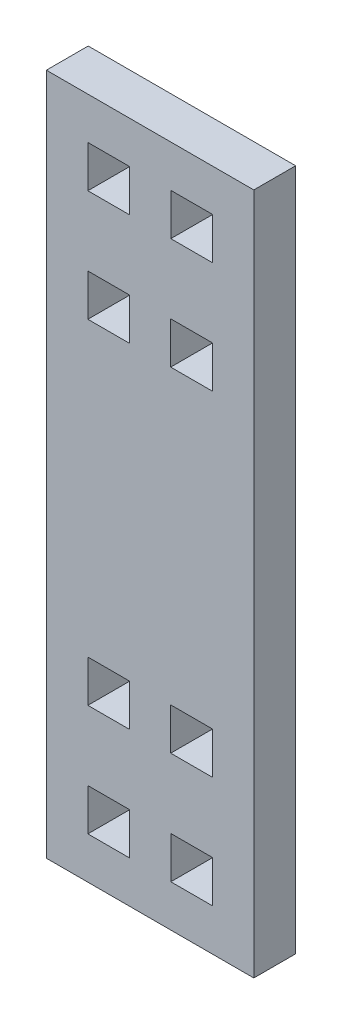
ISO-10303-21;
HEADER;
FILE_DESCRIPTION(('STEP AP214'),'2;1');
FILE_NAME('part.step','',(''),(''),'','','');
FILE_SCHEMA(('AUTOMOTIVE_DESIGN { 1 0 10303 214 1 1 1 1 }'));
ENDSEC;
DATA;
#1=APPLICATION_CONTEXT('core data for automotive mechanical design processes');
#2=APPLICATION_PROTOCOL_DEFINITION('international standard','automotive_design',2000,#1);
#3=PRODUCT_CONTEXT('',#1,'mechanical');
#4=PRODUCT('Part','Part','',(#3));
#5=PRODUCT_RELATED_PRODUCT_CATEGORY('part','',(#4));
#6=PRODUCT_DEFINITION_FORMATION('','',#4);
#7=PRODUCT_DEFINITION_CONTEXT('part definition',#1,'design');
#8=PRODUCT_DEFINITION('design','',#6,#7);
#9=PRODUCT_DEFINITION_SHAPE('','',#8);
#10=(LENGTH_UNIT() NAMED_UNIT(*) SI_UNIT(.MILLI.,.METRE.));
#11=(NAMED_UNIT(*) PLANE_ANGLE_UNIT() SI_UNIT($,.RADIAN.));
#12=(NAMED_UNIT(*) SI_UNIT($,.STERADIAN.) SOLID_ANGLE_UNIT());
#13=UNCERTAINTY_MEASURE_WITH_UNIT(LENGTH_MEASURE(1.E-05),#10,'distance_accuracy_value','');
#14=(GEOMETRIC_REPRESENTATION_CONTEXT(3) GLOBAL_UNCERTAINTY_ASSIGNED_CONTEXT((#13)) GLOBAL_UNIT_ASSIGNED_CONTEXT((#10,
#11,#12)) REPRESENTATION_CONTEXT('',''));
#15=CARTESIAN_POINT('',(0.,0.,0.));
#16=DIRECTION('',(0.,0.,1.));
#17=DIRECTION('',(1.,0.,0.));
#18=AXIS2_PLACEMENT_3D('',#15,#16,#17);
#19=CARTESIAN_POINT('',(0.,0.,5.15));
#20=DIRECTION('',(1.,0.,0.));
#21=DIRECTION('',(0.,0.,-1.));
#22=AXIS2_PLACEMENT_3D('',#19,#20,#21);
#23=PLANE('',#22);
#24=DIRECTION('',(0.,-1.,0.));
#25=VECTOR('',#24,1.);
#26=CARTESIAN_POINT('',(0.,0.,0.));
#27=LINE('',#26,#25);
#28=CARTESIAN_POINT('',(0.,84.,0.));
#29=VERTEX_POINT('',#28);
#30=CARTESIAN_POINT('',(0.,0.,0.));
#31=VERTEX_POINT('',#30);
#32=EDGE_CURVE('E519',#29,#31,#27,.T.);
#33=ORIENTED_EDGE('',*,*,#32,.T.);
#34=DIRECTION('',(0.,0.,-1.));
#35=VECTOR('',#34,1.);
#36=CARTESIAN_POINT('',(0.,0.,5.15));
#37=LINE('',#36,#35);
#38=CARTESIAN_POINT('',(0.,0.,5.15));
#39=VERTEX_POINT('',#38);
#40=EDGE_CURVE('E11',#39,#31,#37,.T.);
#41=ORIENTED_EDGE('',*,*,#40,.F.);
#42=DIRECTION('',(0.,-1.,0.));
#43=VECTOR('',#42,1.);
#44=CARTESIAN_POINT('',(0.,0.,5.15));
#45=LINE('',#44,#43);
#46=CARTESIAN_POINT('',(0.,84.,5.15));
#47=VERTEX_POINT('',#46);
#48=EDGE_CURVE('E526',#47,#39,#45,.T.);
#49=ORIENTED_EDGE('',*,*,#48,.F.);
#50=DIRECTION('',(0.,0.,-1.));
#51=VECTOR('',#50,1.);
#52=CARTESIAN_POINT('',(0.,84.,5.15));
#53=LINE('',#52,#51);
#54=EDGE_CURVE('E536',#47,#29,#53,.T.);
#55=ORIENTED_EDGE('',*,*,#54,.T.);
#56=EDGE_LOOP('',(#33,#41,#49,#55));
#57=FACE_BOUND('',#56,.T.);
#58=ADVANCED_FACE('F33',(#57),#23,.F.);
#59=CARTESIAN_POINT('',(0.,0.,5.15));
#60=DIRECTION('',(0.,1.,0.));
#61=DIRECTION('',(0.,0.,1.));
#62=AXIS2_PLACEMENT_3D('',#59,#60,#61);
#63=PLANE('',#62);
#64=DIRECTION('',(1.,0.,0.));
#65=VECTOR('',#64,1.);
#66=CARTESIAN_POINT('',(0.,0.,0.));
#67=LINE('',#66,#65);
#68=CARTESIAN_POINT('',(25.53,0.,0.));
#69=VERTEX_POINT('',#68);
#70=EDGE_CURVE('E539',#31,#69,#67,.T.);
#71=ORIENTED_EDGE('',*,*,#70,.T.);
#72=DIRECTION('',(0.,0.,-1.));
#73=VECTOR('',#72,1.);
#74=CARTESIAN_POINT('',(25.53,0.,5.15));
#75=LINE('',#74,#73);
#76=CARTESIAN_POINT('',(25.53,0.,5.15));
#77=VERTEX_POINT('',#76);
#78=EDGE_CURVE('E40',#77,#69,#75,.T.);
#79=ORIENTED_EDGE('',*,*,#78,.F.);
#80=DIRECTION('',(1.,0.,0.));
#81=VECTOR('',#80,1.);
#82=CARTESIAN_POINT('',(0.,0.,5.15));
#83=LINE('',#82,#81);
#84=EDGE_CURVE('E529',#39,#77,#83,.T.);
#85=ORIENTED_EDGE('',*,*,#84,.F.);
#86=ORIENTED_EDGE('',*,*,#40,.T.);
#87=EDGE_LOOP('',(#71,#79,#85,#86));
#88=FACE_BOUND('',#87,.T.);
#89=ADVANCED_FACE('F568',(#88),#63,.F.);
#90=CARTESIAN_POINT('',(25.53,0.,5.15));
#91=DIRECTION('',(-1.,0.,0.));
#92=DIRECTION('',(0.,0.,1.));
#93=AXIS2_PLACEMENT_3D('',#90,#91,#92);
#94=PLANE('',#93);
#95=DIRECTION('',(0.,1.,0.));
#96=VECTOR('',#95,1.);
#97=CARTESIAN_POINT('',(25.53,0.,0.));
#98=LINE('',#97,#96);
#99=CARTESIAN_POINT('',(25.53,84.,0.));
#100=VERTEX_POINT('',#99);
#101=EDGE_CURVE('E541',#69,#100,#98,.T.);
#102=ORIENTED_EDGE('',*,*,#101,.T.);
#103=DIRECTION('',(0.,0.,-1.));
#104=VECTOR('',#103,1.);
#105=CARTESIAN_POINT('',(25.53,84.,5.15));
#106=LINE('',#105,#104);
#107=CARTESIAN_POINT('',(25.53,84.,5.15));
#108=VERTEX_POINT('',#107);
#109=EDGE_CURVE('E546',#108,#100,#106,.T.);
#110=ORIENTED_EDGE('',*,*,#109,.F.);
#111=DIRECTION('',(0.,1.,0.));
#112=VECTOR('',#111,1.);
#113=CARTESIAN_POINT('',(25.53,0.,5.15));
#114=LINE('',#113,#112);
#115=EDGE_CURVE('E532',#77,#108,#114,.T.);
#116=ORIENTED_EDGE('',*,*,#115,.F.);
#117=ORIENTED_EDGE('',*,*,#78,.T.);
#118=EDGE_LOOP('',(#102,#110,#116,#117));
#119=FACE_BOUND('',#118,.T.);
#120=ADVANCED_FACE('F553',(#119),#94,.F.);
#121=CARTESIAN_POINT('',(0.,84.,5.15));
#122=DIRECTION('',(0.,-1.,0.));
#123=DIRECTION('',(0.,0.,-1.));
#124=AXIS2_PLACEMENT_3D('',#121,#122,#123);
#125=PLANE('',#124);
#126=DIRECTION('',(-1.,0.,0.));
#127=VECTOR('',#126,1.);
#128=CARTESIAN_POINT('',(0.,84.,0.));
#129=LINE('',#128,#127);
#130=EDGE_CURVE('E530',#100,#29,#129,.T.);
#131=ORIENTED_EDGE('',*,*,#130,.T.);
#132=ORIENTED_EDGE('',*,*,#54,.F.);
#133=DIRECTION('',(-1.,0.,0.));
#134=VECTOR('',#133,1.);
#135=CARTESIAN_POINT('',(0.,84.,5.15));
#136=LINE('',#135,#134);
#137=EDGE_CURVE('E534',#108,#47,#136,.T.);
#138=ORIENTED_EDGE('',*,*,#137,.F.);
#139=ORIENTED_EDGE('',*,*,#109,.T.);
#140=EDGE_LOOP('',(#131,#132,#138,#139));
#141=FACE_BOUND('',#140,.T.);
#142=ADVANCED_FACE('F561',(#141),#125,.F.);
#143=CARTESIAN_POINT('',(0.,0.,5.15));
#144=DIRECTION('',(0.,0.,-1.));
#145=DIRECTION('',(-1.,0.,0.));
#146=AXIS2_PLACEMENT_3D('',#143,#144,#145);
#147=PLANE('',#146);
#148=DIRECTION('',(0.,1.,0.));
#149=VECTOR('',#148,1.);
#150=CARTESIAN_POINT('',(10.256,18.85,5.15));
#151=LINE('',#150,#149);
#152=CARTESIAN_POINT('',(10.256,18.85,5.15));
#153=VERTEX_POINT('',#152);
#154=CARTESIAN_POINT('',(10.256,24.,5.15));
#155=VERTEX_POINT('',#154);
#156=EDGE_CURVE('E292',#153,#155,#151,.T.);
#157=ORIENTED_EDGE('',*,*,#156,.F.);
#158=DIRECTION('',(1.,0.,0.));
#159=VECTOR('',#158,1.);
#160=CARTESIAN_POINT('',(5.10600000000001,18.85,5.15));
#161=LINE('',#160,#159);
#162=CARTESIAN_POINT('',(5.10600000000001,18.85,5.15));
#163=VERTEX_POINT('',#162);
#164=EDGE_CURVE('E47',#163,#153,#161,.T.);
#165=ORIENTED_EDGE('',*,*,#164,.F.);
#166=DIRECTION('',(0.,-1.,0.));
#167=VECTOR('',#166,1.);
#168=CARTESIAN_POINT('',(5.10600000000001,18.85,5.15));
#169=LINE('',#168,#167);
#170=CARTESIAN_POINT('',(5.10600000000002,24.,5.15));
#171=VERTEX_POINT('',#170);
#172=EDGE_CURVE('E283',#171,#163,#169,.T.);
#173=ORIENTED_EDGE('',*,*,#172,.F.);
#174=DIRECTION('',(-1.,0.,0.));
#175=VECTOR('',#174,1.);
#176=CARTESIAN_POINT('',(5.10600000000002,24.,5.15));
#177=LINE('',#176,#175);
#178=EDGE_CURVE('E286',#155,#171,#177,.T.);
#179=ORIENTED_EDGE('',*,*,#178,.F.);
#180=EDGE_LOOP('',(#157,#165,#173,#179));
#181=FACE_BOUND('',#180,.T.);
#182=DIRECTION('',(0.,1.,0.));
#183=VECTOR('',#182,1.);
#184=CARTESIAN_POINT('',(20.4531714978661,18.85,5.15));
#185=LINE('',#184,#183);
#186=CARTESIAN_POINT('',(20.4531714978661,18.85,5.15));
#187=VERTEX_POINT('',#186);
#188=CARTESIAN_POINT('',(20.4531714978661,24.,5.15));
#189=VERTEX_POINT('',#188);
#190=EDGE_CURVE('E317',#187,#189,#185,.T.);
#191=ORIENTED_EDGE('',*,*,#190,.F.);
#192=DIRECTION('',(1.,0.,0.));
#193=VECTOR('',#192,1.);
#194=CARTESIAN_POINT('',(15.3031714978661,18.85,5.15));
#195=LINE('',#194,#193);
#196=CARTESIAN_POINT('',(15.3031714978661,18.85,5.15));
#197=VERTEX_POINT('',#196);
#198=EDGE_CURVE('E298',#197,#187,#195,.T.);
#199=ORIENTED_EDGE('',*,*,#198,.F.);
#200=DIRECTION('',(0.,-1.,0.));
#201=VECTOR('',#200,1.);
#202=CARTESIAN_POINT('',(15.3031714978661,18.85,5.15));
#203=LINE('',#202,#201);
#204=CARTESIAN_POINT('',(15.3031714978661,24.,5.15));
#205=VERTEX_POINT('',#204);
#206=EDGE_CURVE('E306',#205,#197,#203,.T.);
#207=ORIENTED_EDGE('',*,*,#206,.F.);
#208=DIRECTION('',(-1.,0.,0.));
#209=VECTOR('',#208,1.);
#210=CARTESIAN_POINT('',(15.3031714978661,24.,5.15));
#211=LINE('',#210,#209);
#212=EDGE_CURVE('E320',#189,#205,#211,.T.);
#213=ORIENTED_EDGE('',*,*,#212,.F.);
#214=EDGE_LOOP('',(#191,#199,#207,#213));
#215=FACE_BOUND('',#214,.T.);
#216=DIRECTION('',(1.,0.,0.));
#217=VECTOR('',#216,1.);
#218=CARTESIAN_POINT('',(15.3031714978661,60.,5.15));
#219=LINE('',#218,#217);
#220=CARTESIAN_POINT('',(15.3031714978661,60.,5.15));
#221=VERTEX_POINT('',#220);
#222=CARTESIAN_POINT('',(20.4531714978661,60.,5.15));
#223=VERTEX_POINT('',#222);
#224=EDGE_CURVE('E349',#221,#223,#219,.T.);
#225=ORIENTED_EDGE('',*,*,#224,.F.);
#226=DIRECTION('',(0.,-1.,0.));
#227=VECTOR('',#226,1.);
#228=CARTESIAN_POINT('',(15.3031714978661,65.15,5.15));
#229=LINE('',#228,#227);
#230=CARTESIAN_POINT('',(15.3031714978661,65.15,5.15));
#231=VERTEX_POINT('',#230);
#232=EDGE_CURVE('E327',#231,#221,#229,.T.);
#233=ORIENTED_EDGE('',*,*,#232,.F.);
#234=DIRECTION('',(-1.,0.,0.));
#235=VECTOR('',#234,1.);
#236=CARTESIAN_POINT('',(15.3031714978661,65.15,5.15));
#237=LINE('',#236,#235);
#238=CARTESIAN_POINT('',(20.4531714978661,65.15,5.15));
#239=VERTEX_POINT('',#238);
#240=EDGE_CURVE('E338',#239,#231,#237,.T.);
#241=ORIENTED_EDGE('',*,*,#240,.F.);
#242=DIRECTION('',(0.,1.,0.));
#243=VECTOR('',#242,1.);
#244=CARTESIAN_POINT('',(20.4531714978661,65.15,5.15));
#245=LINE('',#244,#243);
#246=EDGE_CURVE('E352',#223,#239,#245,.T.);
#247=ORIENTED_EDGE('',*,*,#246,.F.);
#248=EDGE_LOOP('',(#225,#233,#241,#247));
#249=FACE_BOUND('',#248,.T.);
#250=DIRECTION('',(1.,0.,0.));
#251=VECTOR('',#250,1.);
#252=CARTESIAN_POINT('',(5.106,60.,5.15));
#253=LINE('',#252,#251);
#254=CARTESIAN_POINT('',(5.106,60.,5.15));
#255=VERTEX_POINT('',#254);
#256=CARTESIAN_POINT('',(10.256,60.,5.15));
#257=VERTEX_POINT('',#256);
#258=EDGE_CURVE('E381',#255,#257,#253,.T.);
#259=ORIENTED_EDGE('',*,*,#258,.F.);
#260=DIRECTION('',(0.,-1.,0.));
#261=VECTOR('',#260,1.);
#262=CARTESIAN_POINT('',(5.106,65.15,5.15));
#263=LINE('',#262,#261);
#264=CARTESIAN_POINT('',(5.106,65.15,5.15));
#265=VERTEX_POINT('',#264);
#266=EDGE_CURVE('E359',#265,#255,#263,.T.);
#267=ORIENTED_EDGE('',*,*,#266,.F.);
#268=DIRECTION('',(-1.,0.,0.));
#269=VECTOR('',#268,1.);
#270=CARTESIAN_POINT('',(5.106,65.15,5.15));
#271=LINE('',#270,#269);
#272=CARTESIAN_POINT('',(10.256,65.15,5.15));
#273=VERTEX_POINT('',#272);
#274=EDGE_CURVE('E370',#273,#265,#271,.T.);
#275=ORIENTED_EDGE('',*,*,#274,.F.);
#276=DIRECTION('',(0.,1.,0.));
#277=VECTOR('',#276,1.);
#278=CARTESIAN_POINT('',(10.256,65.15,5.15));
#279=LINE('',#278,#277);
#280=EDGE_CURVE('E384',#257,#273,#279,.T.);
#281=ORIENTED_EDGE('',*,*,#280,.F.);
#282=EDGE_LOOP('',(#259,#267,#275,#281));
#283=FACE_BOUND('',#282,.T.);
#284=DIRECTION('',(0.,1.,0.));
#285=VECTOR('',#284,1.);
#286=CARTESIAN_POINT('',(10.212,5.15,5.15));
#287=LINE('',#286,#285);
#288=CARTESIAN_POINT('',(10.212,5.15,5.15));
#289=VERTEX_POINT('',#288);
#290=CARTESIAN_POINT('',(10.212,10.3,5.15));
#291=VERTEX_POINT('',#290);
#292=EDGE_CURVE('E413',#289,#291,#287,.T.);
#293=ORIENTED_EDGE('',*,*,#292,.F.);
#294=DIRECTION('',(1.,0.,0.));
#295=VECTOR('',#294,1.);
#296=CARTESIAN_POINT('',(5.10600000000001,5.15,5.15));
#297=LINE('',#296,#295);
#298=CARTESIAN_POINT('',(5.10600000000001,5.15,5.15));
#299=VERTEX_POINT('',#298);
#300=EDGE_CURVE('E391',#299,#289,#297,.T.);
#301=ORIENTED_EDGE('',*,*,#300,.F.);
#302=DIRECTION('',(0.,-1.,0.));
#303=VECTOR('',#302,1.);
#304=CARTESIAN_POINT('',(5.10600000000001,5.15,5.15));
#305=LINE('',#304,#303);
#306=CARTESIAN_POINT('',(5.10600000000001,10.3,5.15));
#307=VERTEX_POINT('',#306);
#308=EDGE_CURVE('E402',#307,#299,#305,.T.);
#309=ORIENTED_EDGE('',*,*,#308,.F.);
#310=DIRECTION('',(-1.,0.,0.));
#311=VECTOR('',#310,1.);
#312=CARTESIAN_POINT('',(5.10600000000001,10.3,5.15));
#313=LINE('',#312,#311);
#314=EDGE_CURVE('E416',#291,#307,#313,.T.);
#315=ORIENTED_EDGE('',*,*,#314,.F.);
#316=EDGE_LOOP('',(#293,#301,#309,#315));
#317=FACE_BOUND('',#316,.T.);
#318=DIRECTION('',(0.,1.,0.));
#319=VECTOR('',#318,1.);
#320=CARTESIAN_POINT('',(20.424,5.15,5.15));
#321=LINE('',#320,#319);
#322=CARTESIAN_POINT('',(20.424,5.15,5.15));
#323=VERTEX_POINT('',#322);
#324=CARTESIAN_POINT('',(20.424,10.3,5.15));
#325=VERTEX_POINT('',#324);
#326=EDGE_CURVE('E445',#323,#325,#321,.T.);
#327=ORIENTED_EDGE('',*,*,#326,.F.);
#328=DIRECTION('',(1.,0.,0.));
#329=VECTOR('',#328,1.);
#330=CARTESIAN_POINT('',(15.318,5.15,5.15));
#331=LINE('',#330,#329);
#332=CARTESIAN_POINT('',(15.318,5.15,5.15));
#333=VERTEX_POINT('',#332);
#334=EDGE_CURVE('E423',#333,#323,#331,.T.);
#335=ORIENTED_EDGE('',*,*,#334,.F.);
#336=DIRECTION('',(0.,-1.,0.));
#337=VECTOR('',#336,1.);
#338=CARTESIAN_POINT('',(15.318,5.15,5.15));
#339=LINE('',#338,#337);
#340=CARTESIAN_POINT('',(15.318,10.3,5.15));
#341=VERTEX_POINT('',#340);
#342=EDGE_CURVE('E434',#341,#333,#339,.T.);
#343=ORIENTED_EDGE('',*,*,#342,.F.);
#344=DIRECTION('',(-1.,0.,0.));
#345=VECTOR('',#344,1.);
#346=CARTESIAN_POINT('',(15.318,10.3,5.15));
#347=LINE('',#346,#345);
#348=EDGE_CURVE('E448',#325,#341,#347,.T.);
#349=ORIENTED_EDGE('',*,*,#348,.F.);
#350=EDGE_LOOP('',(#327,#335,#343,#349));
#351=FACE_BOUND('',#350,.T.);
#352=DIRECTION('',(1.,0.,0.));
#353=VECTOR('',#352,1.);
#354=CARTESIAN_POINT('',(15.318,73.7,5.15));
#355=LINE('',#354,#353);
#356=CARTESIAN_POINT('',(15.318,73.7,5.15));
#357=VERTEX_POINT('',#356);
#358=CARTESIAN_POINT('',(20.424,73.7,5.15));
#359=VERTEX_POINT('',#358);
#360=EDGE_CURVE('E477',#357,#359,#355,.T.);
#361=ORIENTED_EDGE('',*,*,#360,.F.);
#362=DIRECTION('',(0.,-1.,0.));
#363=VECTOR('',#362,1.);
#364=CARTESIAN_POINT('',(15.318,78.85,5.15));
#365=LINE('',#364,#363);
#366=CARTESIAN_POINT('',(15.318,78.85,5.15));
#367=VERTEX_POINT('',#366);
#368=EDGE_CURVE('E455',#367,#357,#365,.T.);
#369=ORIENTED_EDGE('',*,*,#368,.F.);
#370=DIRECTION('',(-1.,0.,0.));
#371=VECTOR('',#370,1.);
#372=CARTESIAN_POINT('',(15.318,78.85,5.15));
#373=LINE('',#372,#371);
#374=CARTESIAN_POINT('',(20.424,78.85,5.15));
#375=VERTEX_POINT('',#374);
#376=EDGE_CURVE('E466',#375,#367,#373,.T.);
#377=ORIENTED_EDGE('',*,*,#376,.F.);
#378=DIRECTION('',(0.,1.,0.));
#379=VECTOR('',#378,1.);
#380=CARTESIAN_POINT('',(20.424,78.85,5.15));
#381=LINE('',#380,#379);
#382=EDGE_CURVE('E480',#359,#375,#381,.T.);
#383=ORIENTED_EDGE('',*,*,#382,.F.);
#384=EDGE_LOOP('',(#361,#369,#377,#383));
#385=FACE_BOUND('',#384,.T.);
#386=DIRECTION('',(1.,0.,0.));
#387=VECTOR('',#386,1.);
#388=CARTESIAN_POINT('',(5.106,73.7,5.15));
#389=LINE('',#388,#387);
#390=CARTESIAN_POINT('',(5.106,73.7,5.15));
#391=VERTEX_POINT('',#390);
#392=CARTESIAN_POINT('',(10.212,73.7,5.15));
#393=VERTEX_POINT('',#392);
#394=EDGE_CURVE('E509',#391,#393,#389,.T.);
#395=ORIENTED_EDGE('',*,*,#394,.F.);
#396=DIRECTION('',(0.,-1.,0.));
#397=VECTOR('',#396,1.);
#398=CARTESIAN_POINT('',(5.106,78.85,5.15));
#399=LINE('',#398,#397);
#400=CARTESIAN_POINT('',(5.106,78.85,5.15));
#401=VERTEX_POINT('',#400);
#402=EDGE_CURVE('E487',#401,#391,#399,.T.);
#403=ORIENTED_EDGE('',*,*,#402,.F.);
#404=DIRECTION('',(-1.,0.,0.));
#405=VECTOR('',#404,1.);
#406=CARTESIAN_POINT('',(5.106,78.85,5.15));
#407=LINE('',#406,#405);
#408=CARTESIAN_POINT('',(10.212,78.85,5.15));
#409=VERTEX_POINT('',#408);
#410=EDGE_CURVE('E498',#409,#401,#407,.T.);
#411=ORIENTED_EDGE('',*,*,#410,.F.);
#412=DIRECTION('',(0.,1.,0.));
#413=VECTOR('',#412,1.);
#414=CARTESIAN_POINT('',(10.212,78.85,5.15));
#415=LINE('',#414,#413);
#416=EDGE_CURVE('E512',#393,#409,#415,.T.);
#417=ORIENTED_EDGE('',*,*,#416,.F.);
#418=EDGE_LOOP('',(#395,#403,#411,#417));
#419=FACE_BOUND('',#418,.T.);
#420=ORIENTED_EDGE('',*,*,#48,.T.);
#421=ORIENTED_EDGE('',*,*,#84,.T.);
#422=ORIENTED_EDGE('',*,*,#115,.T.);
#423=ORIENTED_EDGE('',*,*,#137,.T.);
#424=EDGE_LOOP('',(#420,#421,#422,#423));
#425=FACE_BOUND('',#424,.T.);
#426=ADVANCED_FACE('F567',(#181,#215,#249,#283,#317,#351,#385,#419,#425),#147,.F.);
#427=CARTESIAN_POINT('',(0.,0.,0.));
#428=DIRECTION('',(0.,0.,-1.));
#429=DIRECTION('',(-1.,0.,0.));
#430=AXIS2_PLACEMENT_3D('',#427,#428,#429);
#431=PLANE('',#430);
#432=DIRECTION('',(1.,0.,0.));
#433=VECTOR('',#432,1.);
#434=CARTESIAN_POINT('',(5.10600000000001,18.85,0.));
#435=LINE('',#434,#433);
#436=CARTESIAN_POINT('',(5.10600000000001,18.85,0.));
#437=VERTEX_POINT('',#436);
#438=CARTESIAN_POINT('',(10.256,18.85,0.));
#439=VERTEX_POINT('',#438);
#440=EDGE_CURVE('E267',#437,#439,#435,.T.);
#441=ORIENTED_EDGE('',*,*,#440,.T.);
#442=DIRECTION('',(0.,1.,0.));
#443=VECTOR('',#442,1.);
#444=CARTESIAN_POINT('',(10.256,18.85,0.));
#445=LINE('',#444,#443);
#446=CARTESIAN_POINT('',(10.256,24.,0.));
#447=VERTEX_POINT('',#446);
#448=EDGE_CURVE('E276',#439,#447,#445,.T.);
#449=ORIENTED_EDGE('',*,*,#448,.T.);
#450=DIRECTION('',(-1.,0.,0.));
#451=VECTOR('',#450,1.);
#452=CARTESIAN_POINT('',(5.10600000000002,24.,0.));
#453=LINE('',#452,#451);
#454=CARTESIAN_POINT('',(5.10600000000002,24.,0.));
#455=VERTEX_POINT('',#454);
#456=EDGE_CURVE('E55',#447,#455,#453,.T.);
#457=ORIENTED_EDGE('',*,*,#456,.T.);
#458=DIRECTION('',(0.,-1.,0.));
#459=VECTOR('',#458,1.);
#460=CARTESIAN_POINT('',(5.10600000000001,18.85,0.));
#461=LINE('',#460,#459);
#462=EDGE_CURVE('E273',#455,#437,#461,.T.);
#463=ORIENTED_EDGE('',*,*,#462,.T.);
#464=EDGE_LOOP('',(#441,#449,#457,#463));
#465=FACE_BOUND('',#464,.T.);
#466=DIRECTION('',(1.,0.,0.));
#467=VECTOR('',#466,1.);
#468=CARTESIAN_POINT('',(15.3031714978661,18.85,0.));
#469=LINE('',#468,#467);
#470=CARTESIAN_POINT('',(15.3031714978661,18.85,0.));
#471=VERTEX_POINT('',#470);
#472=CARTESIAN_POINT('',(20.4531714978661,18.85,0.));
#473=VERTEX_POINT('',#472);
#474=EDGE_CURVE('E302',#471,#473,#469,.T.);
#475=ORIENTED_EDGE('',*,*,#474,.T.);
#476=DIRECTION('',(0.,1.,0.));
#477=VECTOR('',#476,1.);
#478=CARTESIAN_POINT('',(20.4531714978661,18.85,0.));
#479=LINE('',#478,#477);
#480=CARTESIAN_POINT('',(20.4531714978661,24.,0.));
#481=VERTEX_POINT('',#480);
#482=EDGE_CURVE('E305',#473,#481,#479,.T.);
#483=ORIENTED_EDGE('',*,*,#482,.T.);
#484=DIRECTION('',(-1.,0.,0.));
#485=VECTOR('',#484,1.);
#486=CARTESIAN_POINT('',(15.3031714978661,24.,0.));
#487=LINE('',#486,#485);
#488=CARTESIAN_POINT('',(15.3031714978661,24.,0.));
#489=VERTEX_POINT('',#488);
#490=EDGE_CURVE('E309',#481,#489,#487,.T.);
#491=ORIENTED_EDGE('',*,*,#490,.T.);
#492=DIRECTION('',(0.,-1.,0.));
#493=VECTOR('',#492,1.);
#494=CARTESIAN_POINT('',(15.3031714978661,18.85,0.));
#495=LINE('',#494,#493);
#496=EDGE_CURVE('E312',#489,#471,#495,.T.);
#497=ORIENTED_EDGE('',*,*,#496,.T.);
#498=EDGE_LOOP('',(#475,#483,#491,#497));
#499=FACE_BOUND('',#498,.T.);
#500=DIRECTION('',(0.,-1.,0.));
#501=VECTOR('',#500,1.);
#502=CARTESIAN_POINT('',(15.3031714978661,65.15,0.));
#503=LINE('',#502,#501);
#504=CARTESIAN_POINT('',(15.3031714978661,65.15,0.));
#505=VERTEX_POINT('',#504);
#506=CARTESIAN_POINT('',(15.3031714978661,60.,0.));
#507=VERTEX_POINT('',#506);
#508=EDGE_CURVE('E334',#505,#507,#503,.T.);
#509=ORIENTED_EDGE('',*,*,#508,.T.);
#510=DIRECTION('',(1.,0.,0.));
#511=VECTOR('',#510,1.);
#512=CARTESIAN_POINT('',(15.3031714978661,60.,0.));
#513=LINE('',#512,#511);
#514=CARTESIAN_POINT('',(20.4531714978661,60.,0.));
#515=VERTEX_POINT('',#514);
#516=EDGE_CURVE('E337',#507,#515,#513,.T.);
#517=ORIENTED_EDGE('',*,*,#516,.T.);
#518=DIRECTION('',(0.,1.,0.));
#519=VECTOR('',#518,1.);
#520=CARTESIAN_POINT('',(20.4531714978661,65.15,0.));
#521=LINE('',#520,#519);
#522=CARTESIAN_POINT('',(20.4531714978661,65.15,0.));
#523=VERTEX_POINT('',#522);
#524=EDGE_CURVE('E341',#515,#523,#521,.T.);
#525=ORIENTED_EDGE('',*,*,#524,.T.);
#526=DIRECTION('',(-1.,0.,0.));
#527=VECTOR('',#526,1.);
#528=CARTESIAN_POINT('',(15.3031714978661,65.15,0.));
#529=LINE('',#528,#527);
#530=EDGE_CURVE('E344',#523,#505,#529,.T.);
#531=ORIENTED_EDGE('',*,*,#530,.T.);
#532=EDGE_LOOP('',(#509,#517,#525,#531));
#533=FACE_BOUND('',#532,.T.);
#534=DIRECTION('',(0.,-1.,0.));
#535=VECTOR('',#534,1.);
#536=CARTESIAN_POINT('',(5.106,65.15,0.));
#537=LINE('',#536,#535);
#538=CARTESIAN_POINT('',(5.106,65.15,0.));
#539=VERTEX_POINT('',#538);
#540=CARTESIAN_POINT('',(5.106,60.,0.));
#541=VERTEX_POINT('',#540);
#542=EDGE_CURVE('E366',#539,#541,#537,.T.);
#543=ORIENTED_EDGE('',*,*,#542,.T.);
#544=DIRECTION('',(1.,0.,0.));
#545=VECTOR('',#544,1.);
#546=CARTESIAN_POINT('',(5.106,60.,0.));
#547=LINE('',#546,#545);
#548=CARTESIAN_POINT('',(10.256,60.,0.));
#549=VERTEX_POINT('',#548);
#550=EDGE_CURVE('E369',#541,#549,#547,.T.);
#551=ORIENTED_EDGE('',*,*,#550,.T.);
#552=DIRECTION('',(0.,1.,0.));
#553=VECTOR('',#552,1.);
#554=CARTESIAN_POINT('',(10.256,65.15,0.));
#555=LINE('',#554,#553);
#556=CARTESIAN_POINT('',(10.256,65.15,0.));
#557=VERTEX_POINT('',#556);
#558=EDGE_CURVE('E373',#549,#557,#555,.T.);
#559=ORIENTED_EDGE('',*,*,#558,.T.);
#560=DIRECTION('',(-1.,0.,0.));
#561=VECTOR('',#560,1.);
#562=CARTESIAN_POINT('',(5.106,65.15,0.));
#563=LINE('',#562,#561);
#564=EDGE_CURVE('E376',#557,#539,#563,.T.);
#565=ORIENTED_EDGE('',*,*,#564,.T.);
#566=EDGE_LOOP('',(#543,#551,#559,#565));
#567=FACE_BOUND('',#566,.T.);
#568=DIRECTION('',(1.,0.,0.));
#569=VECTOR('',#568,1.);
#570=CARTESIAN_POINT('',(5.10600000000001,5.15,0.));
#571=LINE('',#570,#569);
#572=CARTESIAN_POINT('',(5.10600000000001,5.15,0.));
#573=VERTEX_POINT('',#572);
#574=CARTESIAN_POINT('',(10.212,5.15,0.));
#575=VERTEX_POINT('',#574);
#576=EDGE_CURVE('E398',#573,#575,#571,.T.);
#577=ORIENTED_EDGE('',*,*,#576,.T.);
#578=DIRECTION('',(0.,1.,0.));
#579=VECTOR('',#578,1.);
#580=CARTESIAN_POINT('',(10.212,5.15,0.));
#581=LINE('',#580,#579);
#582=CARTESIAN_POINT('',(10.212,10.3,0.));
#583=VERTEX_POINT('',#582);
#584=EDGE_CURVE('E401',#575,#583,#581,.T.);
#585=ORIENTED_EDGE('',*,*,#584,.T.);
#586=DIRECTION('',(-1.,0.,0.));
#587=VECTOR('',#586,1.);
#588=CARTESIAN_POINT('',(5.10600000000001,10.3,0.));
#589=LINE('',#588,#587);
#590=CARTESIAN_POINT('',(5.10600000000001,10.3,0.));
#591=VERTEX_POINT('',#590);
#592=EDGE_CURVE('E405',#583,#591,#589,.T.);
#593=ORIENTED_EDGE('',*,*,#592,.T.);
#594=DIRECTION('',(0.,-1.,0.));
#595=VECTOR('',#594,1.);
#596=CARTESIAN_POINT('',(5.10600000000001,5.15,0.));
#597=LINE('',#596,#595);
#598=EDGE_CURVE('E408',#591,#573,#597,.T.);
#599=ORIENTED_EDGE('',*,*,#598,.T.);
#600=EDGE_LOOP('',(#577,#585,#593,#599));
#601=FACE_BOUND('',#600,.T.);
#602=DIRECTION('',(1.,0.,0.));
#603=VECTOR('',#602,1.);
#604=CARTESIAN_POINT('',(15.318,5.15,0.));
#605=LINE('',#604,#603);
#606=CARTESIAN_POINT('',(15.318,5.15,0.));
#607=VERTEX_POINT('',#606);
#608=CARTESIAN_POINT('',(20.424,5.15,0.));
#609=VERTEX_POINT('',#608);
#610=EDGE_CURVE('E430',#607,#609,#605,.T.);
#611=ORIENTED_EDGE('',*,*,#610,.T.);
#612=DIRECTION('',(0.,1.,0.));
#613=VECTOR('',#612,1.);
#614=CARTESIAN_POINT('',(20.424,5.15,0.));
#615=LINE('',#614,#613);
#616=CARTESIAN_POINT('',(20.424,10.3,0.));
#617=VERTEX_POINT('',#616);
#618=EDGE_CURVE('E433',#609,#617,#615,.T.);
#619=ORIENTED_EDGE('',*,*,#618,.T.);
#620=DIRECTION('',(-1.,0.,0.));
#621=VECTOR('',#620,1.);
#622=CARTESIAN_POINT('',(15.318,10.3,0.));
#623=LINE('',#622,#621);
#624=CARTESIAN_POINT('',(15.318,10.3,0.));
#625=VERTEX_POINT('',#624);
#626=EDGE_CURVE('E437',#617,#625,#623,.T.);
#627=ORIENTED_EDGE('',*,*,#626,.T.);
#628=DIRECTION('',(0.,-1.,0.));
#629=VECTOR('',#628,1.);
#630=CARTESIAN_POINT('',(15.318,5.15,0.));
#631=LINE('',#630,#629);
#632=EDGE_CURVE('E440',#625,#607,#631,.T.);
#633=ORIENTED_EDGE('',*,*,#632,.T.);
#634=EDGE_LOOP('',(#611,#619,#627,#633));
#635=FACE_BOUND('',#634,.T.);
#636=DIRECTION('',(0.,-1.,0.));
#637=VECTOR('',#636,1.);
#638=CARTESIAN_POINT('',(15.318,78.85,0.));
#639=LINE('',#638,#637);
#640=CARTESIAN_POINT('',(15.318,78.85,0.));
#641=VERTEX_POINT('',#640);
#642=CARTESIAN_POINT('',(15.318,73.7,0.));
#643=VERTEX_POINT('',#642);
#644=EDGE_CURVE('E462',#641,#643,#639,.T.);
#645=ORIENTED_EDGE('',*,*,#644,.T.);
#646=DIRECTION('',(1.,0.,0.));
#647=VECTOR('',#646,1.);
#648=CARTESIAN_POINT('',(15.318,73.7,0.));
#649=LINE('',#648,#647);
#650=CARTESIAN_POINT('',(20.424,73.7,0.));
#651=VERTEX_POINT('',#650);
#652=EDGE_CURVE('E465',#643,#651,#649,.T.);
#653=ORIENTED_EDGE('',*,*,#652,.T.);
#654=DIRECTION('',(0.,1.,0.));
#655=VECTOR('',#654,1.);
#656=CARTESIAN_POINT('',(20.424,78.85,0.));
#657=LINE('',#656,#655);
#658=CARTESIAN_POINT('',(20.424,78.85,0.));
#659=VERTEX_POINT('',#658);
#660=EDGE_CURVE('E469',#651,#659,#657,.T.);
#661=ORIENTED_EDGE('',*,*,#660,.T.);
#662=DIRECTION('',(-1.,0.,0.));
#663=VECTOR('',#662,1.);
#664=CARTESIAN_POINT('',(15.318,78.85,0.));
#665=LINE('',#664,#663);
#666=EDGE_CURVE('E472',#659,#641,#665,.T.);
#667=ORIENTED_EDGE('',*,*,#666,.T.);
#668=EDGE_LOOP('',(#645,#653,#661,#667));
#669=FACE_BOUND('',#668,.T.);
#670=DIRECTION('',(0.,-1.,0.));
#671=VECTOR('',#670,1.);
#672=CARTESIAN_POINT('',(5.106,78.85,0.));
#673=LINE('',#672,#671);
#674=CARTESIAN_POINT('',(5.106,78.85,0.));
#675=VERTEX_POINT('',#674);
#676=CARTESIAN_POINT('',(5.106,73.7,0.));
#677=VERTEX_POINT('',#676);
#678=EDGE_CURVE('E494',#675,#677,#673,.T.);
#679=ORIENTED_EDGE('',*,*,#678,.T.);
#680=DIRECTION('',(1.,0.,0.));
#681=VECTOR('',#680,1.);
#682=CARTESIAN_POINT('',(5.106,73.7,0.));
#683=LINE('',#682,#681);
#684=CARTESIAN_POINT('',(10.212,73.7,0.));
#685=VERTEX_POINT('',#684);
#686=EDGE_CURVE('E497',#677,#685,#683,.T.);
#687=ORIENTED_EDGE('',*,*,#686,.T.);
#688=DIRECTION('',(0.,1.,0.));
#689=VECTOR('',#688,1.);
#690=CARTESIAN_POINT('',(10.212,78.85,0.));
#691=LINE('',#690,#689);
#692=CARTESIAN_POINT('',(10.212,78.85,0.));
#693=VERTEX_POINT('',#692);
#694=EDGE_CURVE('E501',#685,#693,#691,.T.);
#695=ORIENTED_EDGE('',*,*,#694,.T.);
#696=DIRECTION('',(-1.,0.,0.));
#697=VECTOR('',#696,1.);
#698=CARTESIAN_POINT('',(5.106,78.85,0.));
#699=LINE('',#698,#697);
#700=EDGE_CURVE('E504',#693,#675,#699,.T.);
#701=ORIENTED_EDGE('',*,*,#700,.T.);
#702=EDGE_LOOP('',(#679,#687,#695,#701));
#703=FACE_BOUND('',#702,.T.);
#704=ORIENTED_EDGE('',*,*,#32,.F.);
#705=ORIENTED_EDGE('',*,*,#130,.F.);
#706=ORIENTED_EDGE('',*,*,#101,.F.);
#707=ORIENTED_EDGE('',*,*,#70,.F.);
#708=EDGE_LOOP('',(#704,#705,#706,#707));
#709=FACE_BOUND('',#708,.T.);
#710=ADVANCED_FACE('F280',(#465,#499,#533,#567,#601,#635,#669,#703,#709),#431,.T.);
#711=CARTESIAN_POINT('',(5.106,78.85,0.));
#712=DIRECTION('',(-1.,0.,0.));
#713=DIRECTION('',(0.,-1.,0.));
#714=AXIS2_PLACEMENT_3D('',#711,#712,#713);
#715=PLANE('',#714);
#716=ORIENTED_EDGE('',*,*,#402,.T.);
#717=DIRECTION('',(0.,0.,1.));
#718=VECTOR('',#717,1.);
#719=CARTESIAN_POINT('',(5.106,73.7,0.));
#720=LINE('',#719,#718);
#721=EDGE_CURVE('E507',#677,#391,#720,.T.);
#722=ORIENTED_EDGE('',*,*,#721,.F.);
#723=ORIENTED_EDGE('',*,*,#678,.F.);
#724=DIRECTION('',(0.,0.,1.));
#725=VECTOR('',#724,1.);
#726=CARTESIAN_POINT('',(5.106,78.85,0.));
#727=LINE('',#726,#725);
#728=EDGE_CURVE('E517',#675,#401,#727,.T.);
#729=ORIENTED_EDGE('',*,*,#728,.T.);
#730=EDGE_LOOP('',(#716,#722,#723,#729));
#731=FACE_BOUND('',#730,.T.);
#732=ADVANCED_FACE('F580',(#731),#715,.F.);
#733=CARTESIAN_POINT('',(5.106,78.85,0.));
#734=DIRECTION('',(0.,1.,0.));
#735=DIRECTION('',(0.,0.,1.));
#736=AXIS2_PLACEMENT_3D('',#733,#734,#735);
#737=PLANE('',#736);
#738=ORIENTED_EDGE('',*,*,#410,.T.);
#739=ORIENTED_EDGE('',*,*,#728,.F.);
#740=ORIENTED_EDGE('',*,*,#700,.F.);
#741=DIRECTION('',(0.,0.,1.));
#742=VECTOR('',#741,1.);
#743=CARTESIAN_POINT('',(10.212,78.85,0.));
#744=LINE('',#743,#742);
#745=EDGE_CURVE('E520',#693,#409,#744,.T.);
#746=ORIENTED_EDGE('',*,*,#745,.T.);
#747=EDGE_LOOP('',(#738,#739,#740,#746));
#748=FACE_BOUND('',#747,.T.);
#749=ADVANCED_FACE('F586',(#748),#737,.F.);
#750=CARTESIAN_POINT('',(10.212,78.85,0.));
#751=DIRECTION('',(1.,0.,0.));
#752=DIRECTION('',(0.,1.,0.));
#753=AXIS2_PLACEMENT_3D('',#750,#751,#752);
#754=PLANE('',#753);
#755=ORIENTED_EDGE('',*,*,#416,.T.);
#756=ORIENTED_EDGE('',*,*,#745,.F.);
#757=ORIENTED_EDGE('',*,*,#694,.F.);
#758=DIRECTION('',(0.,0.,1.));
#759=VECTOR('',#758,1.);
#760=CARTESIAN_POINT('',(10.212,73.7,0.));
#761=LINE('',#760,#759);
#762=EDGE_CURVE('E522',#685,#393,#761,.T.);
#763=ORIENTED_EDGE('',*,*,#762,.T.);
#764=EDGE_LOOP('',(#755,#756,#757,#763));
#765=FACE_BOUND('',#764,.T.);
#766=ADVANCED_FACE('F592',(#765),#754,.F.);
#767=CARTESIAN_POINT('',(5.106,73.7,0.));
#768=DIRECTION('',(0.,-1.,0.));
#769=DIRECTION('',(1.,0.,0.));
#770=AXIS2_PLACEMENT_3D('',#767,#768,#769);
#771=PLANE('',#770);
#772=ORIENTED_EDGE('',*,*,#394,.T.);
#773=ORIENTED_EDGE('',*,*,#762,.F.);
#774=ORIENTED_EDGE('',*,*,#686,.F.);
#775=ORIENTED_EDGE('',*,*,#721,.T.);
#776=EDGE_LOOP('',(#772,#773,#774,#775));
#777=FACE_BOUND('',#776,.T.);
#778=ADVANCED_FACE('F588',(#777),#771,.F.);
#779=CARTESIAN_POINT('',(15.318,78.85,0.));
#780=DIRECTION('',(-1.,0.,0.));
#781=DIRECTION('',(0.,-1.,0.));
#782=AXIS2_PLACEMENT_3D('',#779,#780,#781);
#783=PLANE('',#782);
#784=ORIENTED_EDGE('',*,*,#368,.T.);
#785=DIRECTION('',(0.,0.,1.));
#786=VECTOR('',#785,1.);
#787=CARTESIAN_POINT('',(15.318,73.7,0.));
#788=LINE('',#787,#786);
#789=EDGE_CURVE('E475',#643,#357,#788,.T.);
#790=ORIENTED_EDGE('',*,*,#789,.F.);
#791=ORIENTED_EDGE('',*,*,#644,.F.);
#792=DIRECTION('',(0.,0.,1.));
#793=VECTOR('',#792,1.);
#794=CARTESIAN_POINT('',(15.318,78.85,0.));
#795=LINE('',#794,#793);
#796=EDGE_CURVE('E485',#641,#367,#795,.T.);
#797=ORIENTED_EDGE('',*,*,#796,.T.);
#798=EDGE_LOOP('',(#784,#790,#791,#797));
#799=FACE_BOUND('',#798,.T.);
#800=ADVANCED_FACE('F591',(#799),#783,.F.);
#801=CARTESIAN_POINT('',(15.318,78.85,0.));
#802=DIRECTION('',(0.,1.,0.));
#803=DIRECTION('',(0.,0.,1.));
#804=AXIS2_PLACEMENT_3D('',#801,#802,#803);
#805=PLANE('',#804);
#806=ORIENTED_EDGE('',*,*,#376,.T.);
#807=ORIENTED_EDGE('',*,*,#796,.F.);
#808=ORIENTED_EDGE('',*,*,#666,.F.);
#809=DIRECTION('',(0.,0.,1.));
#810=VECTOR('',#809,1.);
#811=CARTESIAN_POINT('',(20.424,78.85,0.));
#812=LINE('',#811,#810);
#813=EDGE_CURVE('E488',#659,#375,#812,.T.);
#814=ORIENTED_EDGE('',*,*,#813,.T.);
#815=EDGE_LOOP('',(#806,#807,#808,#814));
#816=FACE_BOUND('',#815,.T.);
#817=ADVANCED_FACE('F602',(#816),#805,.F.);
#818=CARTESIAN_POINT('',(20.424,78.85,0.));
#819=DIRECTION('',(1.,0.,0.));
#820=DIRECTION('',(0.,0.,-1.));
#821=AXIS2_PLACEMENT_3D('',#818,#819,#820);
#822=PLANE('',#821);
#823=ORIENTED_EDGE('',*,*,#382,.T.);
#824=ORIENTED_EDGE('',*,*,#813,.F.);
#825=ORIENTED_EDGE('',*,*,#660,.F.);
#826=DIRECTION('',(0.,0.,1.));
#827=VECTOR('',#826,1.);
#828=CARTESIAN_POINT('',(20.424,73.7,0.));
#829=LINE('',#828,#827);
#830=EDGE_CURVE('E490',#651,#359,#829,.T.);
#831=ORIENTED_EDGE('',*,*,#830,.T.);
#832=EDGE_LOOP('',(#823,#824,#825,#831));
#833=FACE_BOUND('',#832,.T.);
#834=ADVANCED_FACE('F608',(#833),#822,.F.);
#835=CARTESIAN_POINT('',(15.318,73.7,0.));
#836=DIRECTION('',(0.,-1.,0.));
#837=DIRECTION('',(0.,0.,-1.));
#838=AXIS2_PLACEMENT_3D('',#835,#836,#837);
#839=PLANE('',#838);
#840=ORIENTED_EDGE('',*,*,#360,.T.);
#841=ORIENTED_EDGE('',*,*,#830,.F.);
#842=ORIENTED_EDGE('',*,*,#652,.F.);
#843=ORIENTED_EDGE('',*,*,#789,.T.);
#844=EDGE_LOOP('',(#840,#841,#842,#843));
#845=FACE_BOUND('',#844,.T.);
#846=ADVANCED_FACE('F604',(#845),#839,.F.);
#847=CARTESIAN_POINT('',(15.318,5.15,0.));
#848=DIRECTION('',(0.,-1.,0.));
#849=DIRECTION('',(1.,0.,0.));
#850=AXIS2_PLACEMENT_3D('',#847,#848,#849);
#851=PLANE('',#850);
#852=ORIENTED_EDGE('',*,*,#334,.T.);
#853=DIRECTION('',(0.,0.,1.));
#854=VECTOR('',#853,1.);
#855=CARTESIAN_POINT('',(20.424,5.15,0.));
#856=LINE('',#855,#854);
#857=EDGE_CURVE('E443',#609,#323,#856,.T.);
#858=ORIENTED_EDGE('',*,*,#857,.F.);
#859=ORIENTED_EDGE('',*,*,#610,.F.);
#860=DIRECTION('',(0.,0.,1.));
#861=VECTOR('',#860,1.);
#862=CARTESIAN_POINT('',(15.318,5.15,0.));
#863=LINE('',#862,#861);
#864=EDGE_CURVE('E453',#607,#333,#863,.T.);
#865=ORIENTED_EDGE('',*,*,#864,.T.);
#866=EDGE_LOOP('',(#852,#858,#859,#865));
#867=FACE_BOUND('',#866,.T.);
#868=ADVANCED_FACE('F607',(#867),#851,.F.);
#869=CARTESIAN_POINT('',(15.318,5.15,0.));
#870=DIRECTION('',(-1.,0.,0.));
#871=DIRECTION('',(0.,0.,1.));
#872=AXIS2_PLACEMENT_3D('',#869,#870,#871);
#873=PLANE('',#872);
#874=ORIENTED_EDGE('',*,*,#342,.T.);
#875=ORIENTED_EDGE('',*,*,#864,.F.);
#876=ORIENTED_EDGE('',*,*,#632,.F.);
#877=DIRECTION('',(0.,0.,1.));
#878=VECTOR('',#877,1.);
#879=CARTESIAN_POINT('',(15.318,10.3,0.));
#880=LINE('',#879,#878);
#881=EDGE_CURVE('E456',#625,#341,#880,.T.);
#882=ORIENTED_EDGE('',*,*,#881,.T.);
#883=EDGE_LOOP('',(#874,#875,#876,#882));
#884=FACE_BOUND('',#883,.T.);
#885=ADVANCED_FACE('F618',(#884),#873,.F.);
#886=CARTESIAN_POINT('',(15.318,10.3,0.));
#887=DIRECTION('',(0.,1.,0.));
#888=DIRECTION('',(0.,0.,1.));
#889=AXIS2_PLACEMENT_3D('',#886,#887,#888);
#890=PLANE('',#889);
#891=ORIENTED_EDGE('',*,*,#348,.T.);
#892=ORIENTED_EDGE('',*,*,#881,.F.);
#893=ORIENTED_EDGE('',*,*,#626,.F.);
#894=DIRECTION('',(0.,0.,1.));
#895=VECTOR('',#894,1.);
#896=CARTESIAN_POINT('',(20.424,10.3,0.));
#897=LINE('',#896,#895);
#898=EDGE_CURVE('E458',#617,#325,#897,.T.);
#899=ORIENTED_EDGE('',*,*,#898,.T.);
#900=EDGE_LOOP('',(#891,#892,#893,#899));
#901=FACE_BOUND('',#900,.T.);
#902=ADVANCED_FACE('F624',(#901),#890,.F.);
#903=CARTESIAN_POINT('',(20.424,5.15,0.));
#904=DIRECTION('',(1.,0.,0.));
#905=DIRECTION('',(0.,1.,0.));
#906=AXIS2_PLACEMENT_3D('',#903,#904,#905);
#907=PLANE('',#906);
#908=ORIENTED_EDGE('',*,*,#326,.T.);
#909=ORIENTED_EDGE('',*,*,#898,.F.);
#910=ORIENTED_EDGE('',*,*,#618,.F.);
#911=ORIENTED_EDGE('',*,*,#857,.T.);
#912=EDGE_LOOP('',(#908,#909,#910,#911));
#913=FACE_BOUND('',#912,.T.);
#914=ADVANCED_FACE('F620',(#913),#907,.F.);
#915=CARTESIAN_POINT('',(5.10600000000001,5.15,0.));
#916=DIRECTION('',(0.,-1.,0.));
#917=DIRECTION('',(1.,0.,0.));
#918=AXIS2_PLACEMENT_3D('',#915,#916,#917);
#919=PLANE('',#918);
#920=ORIENTED_EDGE('',*,*,#300,.T.);
#921=DIRECTION('',(0.,0.,1.));
#922=VECTOR('',#921,1.);
#923=CARTESIAN_POINT('',(10.212,5.15,0.));
#924=LINE('',#923,#922);
#925=EDGE_CURVE('E411',#575,#289,#924,.T.);
#926=ORIENTED_EDGE('',*,*,#925,.F.);
#927=ORIENTED_EDGE('',*,*,#576,.F.);
#928=DIRECTION('',(0.,0.,1.));
#929=VECTOR('',#928,1.);
#930=CARTESIAN_POINT('',(5.10600000000001,5.15,0.));
#931=LINE('',#930,#929);
#932=EDGE_CURVE('E421',#573,#299,#931,.T.);
#933=ORIENTED_EDGE('',*,*,#932,.T.);
#934=EDGE_LOOP('',(#920,#926,#927,#933));
#935=FACE_BOUND('',#934,.T.);
#936=ADVANCED_FACE('F623',(#935),#919,.F.);
#937=CARTESIAN_POINT('',(5.10600000000001,5.15,0.));
#938=DIRECTION('',(-1.,0.,0.));
#939=DIRECTION('',(0.,-1.,0.));
#940=AXIS2_PLACEMENT_3D('',#937,#938,#939);
#941=PLANE('',#940);
#942=ORIENTED_EDGE('',*,*,#308,.T.);
#943=ORIENTED_EDGE('',*,*,#932,.F.);
#944=ORIENTED_EDGE('',*,*,#598,.F.);
#945=DIRECTION('',(0.,0.,1.));
#946=VECTOR('',#945,1.);
#947=CARTESIAN_POINT('',(5.10600000000001,10.3,0.));
#948=LINE('',#947,#946);
#949=EDGE_CURVE('E424',#591,#307,#948,.T.);
#950=ORIENTED_EDGE('',*,*,#949,.T.);
#951=EDGE_LOOP('',(#942,#943,#944,#950));
#952=FACE_BOUND('',#951,.T.);
#953=ADVANCED_FACE('F634',(#952),#941,.F.);
#954=CARTESIAN_POINT('',(5.10600000000001,10.3,0.));
#955=DIRECTION('',(0.,1.,0.));
#956=DIRECTION('',(0.,0.,1.));
#957=AXIS2_PLACEMENT_3D('',#954,#955,#956);
#958=PLANE('',#957);
#959=ORIENTED_EDGE('',*,*,#314,.T.);
#960=ORIENTED_EDGE('',*,*,#949,.F.);
#961=ORIENTED_EDGE('',*,*,#592,.F.);
#962=DIRECTION('',(0.,0.,1.));
#963=VECTOR('',#962,1.);
#964=CARTESIAN_POINT('',(10.212,10.3,0.));
#965=LINE('',#964,#963);
#966=EDGE_CURVE('E426',#583,#291,#965,.T.);
#967=ORIENTED_EDGE('',*,*,#966,.T.);
#968=EDGE_LOOP('',(#959,#960,#961,#967));
#969=FACE_BOUND('',#968,.T.);
#970=ADVANCED_FACE('F640',(#969),#958,.F.);
#971=CARTESIAN_POINT('',(10.212,5.15,0.));
#972=DIRECTION('',(1.,0.,0.));
#973=DIRECTION('',(0.,1.,0.));
#974=AXIS2_PLACEMENT_3D('',#971,#972,#973);
#975=PLANE('',#974);
#976=ORIENTED_EDGE('',*,*,#292,.T.);
#977=ORIENTED_EDGE('',*,*,#966,.F.);
#978=ORIENTED_EDGE('',*,*,#584,.F.);
#979=ORIENTED_EDGE('',*,*,#925,.T.);
#980=EDGE_LOOP('',(#976,#977,#978,#979));
#981=FACE_BOUND('',#980,.T.);
#982=ADVANCED_FACE('F636',(#981),#975,.F.);
#983=CARTESIAN_POINT('',(5.106,65.15,0.));
#984=DIRECTION('',(-1.,0.,0.));
#985=DIRECTION('',(0.,-1.,0.));
#986=AXIS2_PLACEMENT_3D('',#983,#984,#985);
#987=PLANE('',#986);
#988=ORIENTED_EDGE('',*,*,#266,.T.);
#989=DIRECTION('',(0.,0.,1.));
#990=VECTOR('',#989,1.);
#991=CARTESIAN_POINT('',(5.106,60.,0.));
#992=LINE('',#991,#990);
#993=EDGE_CURVE('E379',#541,#255,#992,.T.);
#994=ORIENTED_EDGE('',*,*,#993,.F.);
#995=ORIENTED_EDGE('',*,*,#542,.F.);
#996=DIRECTION('',(0.,0.,1.));
#997=VECTOR('',#996,1.);
#998=CARTESIAN_POINT('',(5.106,65.15,0.));
#999=LINE('',#998,#997);
#1000=EDGE_CURVE('E389',#539,#265,#999,.T.);
#1001=ORIENTED_EDGE('',*,*,#1000,.T.);
#1002=EDGE_LOOP('',(#988,#994,#995,#1001));
#1003=FACE_BOUND('',#1002,.T.);
#1004=ADVANCED_FACE('F639',(#1003),#987,.F.);
#1005=CARTESIAN_POINT('',(5.106,65.15,0.));
#1006=DIRECTION('',(0.,1.,0.));
#1007=DIRECTION('',(-1.,0.,0.));
#1008=AXIS2_PLACEMENT_3D('',#1005,#1006,#1007);
#1009=PLANE('',#1008);
#1010=ORIENTED_EDGE('',*,*,#274,.T.);
#1011=ORIENTED_EDGE('',*,*,#1000,.F.);
#1012=ORIENTED_EDGE('',*,*,#564,.F.);
#1013=DIRECTION('',(0.,0.,1.));
#1014=VECTOR('',#1013,1.);
#1015=CARTESIAN_POINT('',(10.256,65.15,0.));
#1016=LINE('',#1015,#1014);
#1017=EDGE_CURVE('E392',#557,#273,#1016,.T.);
#1018=ORIENTED_EDGE('',*,*,#1017,.T.);
#1019=EDGE_LOOP('',(#1010,#1011,#1012,#1018));
#1020=FACE_BOUND('',#1019,.T.);
#1021=ADVANCED_FACE('F650',(#1020),#1009,.F.);
#1022=CARTESIAN_POINT('',(10.256,65.15,0.));
#1023=DIRECTION('',(1.,0.,0.));
#1024=DIRECTION('',(0.,0.,-1.));
#1025=AXIS2_PLACEMENT_3D('',#1022,#1023,#1024);
#1026=PLANE('',#1025);
#1027=ORIENTED_EDGE('',*,*,#280,.T.);
#1028=ORIENTED_EDGE('',*,*,#1017,.F.);
#1029=ORIENTED_EDGE('',*,*,#558,.F.);
#1030=DIRECTION('',(0.,0.,1.));
#1031=VECTOR('',#1030,1.);
#1032=CARTESIAN_POINT('',(10.256,60.,0.));
#1033=LINE('',#1032,#1031);
#1034=EDGE_CURVE('E394',#549,#257,#1033,.T.);
#1035=ORIENTED_EDGE('',*,*,#1034,.T.);
#1036=EDGE_LOOP('',(#1027,#1028,#1029,#1035));
#1037=FACE_BOUND('',#1036,.T.);
#1038=ADVANCED_FACE('F656',(#1037),#1026,.F.);
#1039=CARTESIAN_POINT('',(5.106,60.,0.));
#1040=DIRECTION('',(0.,-1.,0.));
#1041=DIRECTION('',(0.,0.,-1.));
#1042=AXIS2_PLACEMENT_3D('',#1039,#1040,#1041);
#1043=PLANE('',#1042);
#1044=ORIENTED_EDGE('',*,*,#258,.T.);
#1045=ORIENTED_EDGE('',*,*,#1034,.F.);
#1046=ORIENTED_EDGE('',*,*,#550,.F.);
#1047=ORIENTED_EDGE('',*,*,#993,.T.);
#1048=EDGE_LOOP('',(#1044,#1045,#1046,#1047));
#1049=FACE_BOUND('',#1048,.T.);
#1050=ADVANCED_FACE('F652',(#1049),#1043,.F.);
#1051=CARTESIAN_POINT('',(15.3031714978661,65.15,0.));
#1052=DIRECTION('',(-1.,0.,0.));
#1053=DIRECTION('',(0.,-1.,0.));
#1054=AXIS2_PLACEMENT_3D('',#1051,#1052,#1053);
#1055=PLANE('',#1054);
#1056=ORIENTED_EDGE('',*,*,#232,.T.);
#1057=DIRECTION('',(0.,0.,1.));
#1058=VECTOR('',#1057,1.);
#1059=CARTESIAN_POINT('',(15.3031714978661,60.,0.));
#1060=LINE('',#1059,#1058);
#1061=EDGE_CURVE('E347',#507,#221,#1060,.T.);
#1062=ORIENTED_EDGE('',*,*,#1061,.F.);
#1063=ORIENTED_EDGE('',*,*,#508,.F.);
#1064=DIRECTION('',(0.,0.,1.));
#1065=VECTOR('',#1064,1.);
#1066=CARTESIAN_POINT('',(15.3031714978661,65.15,0.));
#1067=LINE('',#1066,#1065);
#1068=EDGE_CURVE('E357',#505,#231,#1067,.T.);
#1069=ORIENTED_EDGE('',*,*,#1068,.T.);
#1070=EDGE_LOOP('',(#1056,#1062,#1063,#1069));
#1071=FACE_BOUND('',#1070,.T.);
#1072=ADVANCED_FACE('F655',(#1071),#1055,.F.);
#1073=CARTESIAN_POINT('',(15.3031714978661,65.15,0.));
#1074=DIRECTION('',(0.,1.,0.));
#1075=DIRECTION('',(0.,0.,1.));
#1076=AXIS2_PLACEMENT_3D('',#1073,#1074,#1075);
#1077=PLANE('',#1076);
#1078=ORIENTED_EDGE('',*,*,#240,.T.);
#1079=ORIENTED_EDGE('',*,*,#1068,.F.);
#1080=ORIENTED_EDGE('',*,*,#530,.F.);
#1081=DIRECTION('',(0.,0.,1.));
#1082=VECTOR('',#1081,1.);
#1083=CARTESIAN_POINT('',(20.4531714978661,65.15,0.));
#1084=LINE('',#1083,#1082);
#1085=EDGE_CURVE('E360',#523,#239,#1084,.T.);
#1086=ORIENTED_EDGE('',*,*,#1085,.T.);
#1087=EDGE_LOOP('',(#1078,#1079,#1080,#1086));
#1088=FACE_BOUND('',#1087,.T.);
#1089=ADVANCED_FACE('F666',(#1088),#1077,.F.);
#1090=CARTESIAN_POINT('',(20.4531714978661,65.15,0.));
#1091=DIRECTION('',(1.,0.,0.));
#1092=DIRECTION('',(0.,0.,-1.));
#1093=AXIS2_PLACEMENT_3D('',#1090,#1091,#1092);
#1094=PLANE('',#1093);
#1095=ORIENTED_EDGE('',*,*,#246,.T.);
#1096=ORIENTED_EDGE('',*,*,#1085,.F.);
#1097=ORIENTED_EDGE('',*,*,#524,.F.);
#1098=DIRECTION('',(0.,0.,1.));
#1099=VECTOR('',#1098,1.);
#1100=CARTESIAN_POINT('',(20.4531714978661,60.,0.));
#1101=LINE('',#1100,#1099);
#1102=EDGE_CURVE('E362',#515,#223,#1101,.T.);
#1103=ORIENTED_EDGE('',*,*,#1102,.T.);
#1104=EDGE_LOOP('',(#1095,#1096,#1097,#1103));
#1105=FACE_BOUND('',#1104,.T.);
#1106=ADVANCED_FACE('F672',(#1105),#1094,.F.);
#1107=CARTESIAN_POINT('',(15.3031714978661,60.,0.));
#1108=DIRECTION('',(0.,-1.,0.));
#1109=DIRECTION('',(0.,0.,-1.));
#1110=AXIS2_PLACEMENT_3D('',#1107,#1108,#1109);
#1111=PLANE('',#1110);
#1112=ORIENTED_EDGE('',*,*,#224,.T.);
#1113=ORIENTED_EDGE('',*,*,#1102,.F.);
#1114=ORIENTED_EDGE('',*,*,#516,.F.);
#1115=ORIENTED_EDGE('',*,*,#1061,.T.);
#1116=EDGE_LOOP('',(#1112,#1113,#1114,#1115));
#1117=FACE_BOUND('',#1116,.T.);
#1118=ADVANCED_FACE('F668',(#1117),#1111,.F.);
#1119=CARTESIAN_POINT('',(15.3031714978661,18.85,0.));
#1120=DIRECTION('',(0.,-1.,0.));
#1121=DIRECTION('',(0.,0.,-1.));
#1122=AXIS2_PLACEMENT_3D('',#1119,#1120,#1121);
#1123=PLANE('',#1122);
#1124=ORIENTED_EDGE('',*,*,#198,.T.);
#1125=DIRECTION('',(0.,0.,1.));
#1126=VECTOR('',#1125,1.);
#1127=CARTESIAN_POINT('',(20.4531714978661,18.85,0.));
#1128=LINE('',#1127,#1126);
#1129=EDGE_CURVE('E315',#473,#187,#1128,.T.);
#1130=ORIENTED_EDGE('',*,*,#1129,.F.);
#1131=ORIENTED_EDGE('',*,*,#474,.F.);
#1132=DIRECTION('',(0.,0.,1.));
#1133=VECTOR('',#1132,1.);
#1134=CARTESIAN_POINT('',(15.3031714978661,18.85,0.));
#1135=LINE('',#1134,#1133);
#1136=EDGE_CURVE('E325',#471,#197,#1135,.T.);
#1137=ORIENTED_EDGE('',*,*,#1136,.T.);
#1138=EDGE_LOOP('',(#1124,#1130,#1131,#1137));
#1139=FACE_BOUND('',#1138,.T.);
#1140=ADVANCED_FACE('F671',(#1139),#1123,.F.);
#1141=CARTESIAN_POINT('',(15.3031714978661,18.85,0.));
#1142=DIRECTION('',(-1.,0.,0.));
#1143=DIRECTION('',(0.,-1.,0.));
#1144=AXIS2_PLACEMENT_3D('',#1141,#1142,#1143);
#1145=PLANE('',#1144);
#1146=ORIENTED_EDGE('',*,*,#206,.T.);
#1147=ORIENTED_EDGE('',*,*,#1136,.F.);
#1148=ORIENTED_EDGE('',*,*,#496,.F.);
#1149=DIRECTION('',(0.,0.,1.));
#1150=VECTOR('',#1149,1.);
#1151=CARTESIAN_POINT('',(15.3031714978661,24.,0.));
#1152=LINE('',#1151,#1150);
#1153=EDGE_CURVE('E328',#489,#205,#1152,.T.);
#1154=ORIENTED_EDGE('',*,*,#1153,.T.);
#1155=EDGE_LOOP('',(#1146,#1147,#1148,#1154));
#1156=FACE_BOUND('',#1155,.T.);
#1157=ADVANCED_FACE('F682',(#1156),#1145,.F.);
#1158=CARTESIAN_POINT('',(15.3031714978661,24.,0.));
#1159=DIRECTION('',(0.,1.,0.));
#1160=DIRECTION('',(-1.,0.,0.));
#1161=AXIS2_PLACEMENT_3D('',#1158,#1159,#1160);
#1162=PLANE('',#1161);
#1163=ORIENTED_EDGE('',*,*,#212,.T.);
#1164=ORIENTED_EDGE('',*,*,#1153,.F.);
#1165=ORIENTED_EDGE('',*,*,#490,.F.);
#1166=DIRECTION('',(0.,0.,1.));
#1167=VECTOR('',#1166,1.);
#1168=CARTESIAN_POINT('',(20.4531714978661,24.,0.));
#1169=LINE('',#1168,#1167);
#1170=EDGE_CURVE('E330',#481,#189,#1169,.T.);
#1171=ORIENTED_EDGE('',*,*,#1170,.T.);
#1172=EDGE_LOOP('',(#1163,#1164,#1165,#1171));
#1173=FACE_BOUND('',#1172,.T.);
#1174=ADVANCED_FACE('F687',(#1173),#1162,.F.);
#1175=CARTESIAN_POINT('',(20.4531714978661,18.85,0.));
#1176=DIRECTION('',(1.,0.,0.));
#1177=DIRECTION('',(0.,1.,0.));
#1178=AXIS2_PLACEMENT_3D('',#1175,#1176,#1177);
#1179=PLANE('',#1178);
#1180=ORIENTED_EDGE('',*,*,#190,.T.);
#1181=ORIENTED_EDGE('',*,*,#1170,.F.);
#1182=ORIENTED_EDGE('',*,*,#482,.F.);
#1183=ORIENTED_EDGE('',*,*,#1129,.T.);
#1184=EDGE_LOOP('',(#1180,#1181,#1182,#1183));
#1185=FACE_BOUND('',#1184,.T.);
#1186=ADVANCED_FACE('F684',(#1185),#1179,.F.);
#1187=CARTESIAN_POINT('',(5.10600000000001,18.85,0.));
#1188=DIRECTION('',(0.,-1.,0.));
#1189=DIRECTION('',(1.,0.,0.));
#1190=AXIS2_PLACEMENT_3D('',#1187,#1188,#1189);
#1191=PLANE('',#1190);
#1192=ORIENTED_EDGE('',*,*,#164,.T.);
#1193=DIRECTION('',(0.,0.,1.));
#1194=VECTOR('',#1193,1.);
#1195=CARTESIAN_POINT('',(10.256,18.85,0.));
#1196=LINE('',#1195,#1194);
#1197=EDGE_CURVE('E263',#439,#153,#1196,.T.);
#1198=ORIENTED_EDGE('',*,*,#1197,.F.);
#1199=ORIENTED_EDGE('',*,*,#440,.F.);
#1200=DIRECTION('',(0.,0.,1.));
#1201=VECTOR('',#1200,1.);
#1202=CARTESIAN_POINT('',(5.10600000000001,18.85,0.));
#1203=LINE('',#1202,#1201);
#1204=EDGE_CURVE('E296',#437,#163,#1203,.T.);
#1205=ORIENTED_EDGE('',*,*,#1204,.T.);
#1206=EDGE_LOOP('',(#1192,#1198,#1199,#1205));
#1207=FACE_BOUND('',#1206,.T.);
#1208=ADVANCED_FACE('F265',(#1207),#1191,.F.);
#1209=CARTESIAN_POINT('',(5.10600000000001,18.85,0.));
#1210=DIRECTION('',(-1.,0.,0.));
#1211=DIRECTION('',(0.,-1.,0.));
#1212=AXIS2_PLACEMENT_3D('',#1209,#1210,#1211);
#1213=PLANE('',#1212);
#1214=ORIENTED_EDGE('',*,*,#172,.T.);
#1215=ORIENTED_EDGE('',*,*,#1204,.F.);
#1216=ORIENTED_EDGE('',*,*,#462,.F.);
#1217=DIRECTION('',(0.,0.,1.));
#1218=VECTOR('',#1217,1.);
#1219=CARTESIAN_POINT('',(5.10600000000002,24.,0.));
#1220=LINE('',#1219,#1218);
#1221=EDGE_CURVE('E299',#455,#171,#1220,.T.);
#1222=ORIENTED_EDGE('',*,*,#1221,.T.);
#1223=EDGE_LOOP('',(#1214,#1215,#1216,#1222));
#1224=FACE_BOUND('',#1223,.T.);
#1225=ADVANCED_FACE('F697',(#1224),#1213,.F.);
#1226=CARTESIAN_POINT('',(5.10600000000002,24.,0.));
#1227=DIRECTION('',(0.,1.,0.));
#1228=DIRECTION('',(-1.,0.,0.));
#1229=AXIS2_PLACEMENT_3D('',#1226,#1227,#1228);
#1230=PLANE('',#1229);
#1231=ORIENTED_EDGE('',*,*,#178,.T.);
#1232=ORIENTED_EDGE('',*,*,#1221,.F.);
#1233=ORIENTED_EDGE('',*,*,#456,.F.);
#1234=DIRECTION('',(0.,0.,1.));
#1235=VECTOR('',#1234,1.);
#1236=CARTESIAN_POINT('',(10.256,24.,0.));
#1237=LINE('',#1236,#1235);
#1238=EDGE_CURVE('E272',#447,#155,#1237,.T.);
#1239=ORIENTED_EDGE('',*,*,#1238,.T.);
#1240=EDGE_LOOP('',(#1231,#1232,#1233,#1239));
#1241=FACE_BOUND('',#1240,.T.);
#1242=ADVANCED_FACE('F700',(#1241),#1230,.F.);
#1243=CARTESIAN_POINT('',(10.256,18.85,0.));
#1244=DIRECTION('',(1.,0.,0.));
#1245=DIRECTION('',(0.,0.,-1.));
#1246=AXIS2_PLACEMENT_3D('',#1243,#1244,#1245);
#1247=PLANE('',#1246);
#1248=ORIENTED_EDGE('',*,*,#156,.T.);
#1249=ORIENTED_EDGE('',*,*,#1238,.F.);
#1250=ORIENTED_EDGE('',*,*,#448,.F.);
#1251=ORIENTED_EDGE('',*,*,#1197,.T.);
#1252=EDGE_LOOP('',(#1248,#1249,#1250,#1251));
#1253=FACE_BOUND('',#1252,.T.);
#1254=ADVANCED_FACE('F277',(#1253),#1247,.F.);
#1255=CLOSED_SHELL('',(#58,#89,#120,#142,#426,#710,#732,#749,#766,#778,#800,#817,#834,#846,#868,
#885,#902,#914,#936,#953,#970,#982,#1004,#1021,#1038,#1050,#1072,#1089,#1106,#1118,#1140,#1157,
#1174,#1186,#1208,#1225,#1242,#1254));
#1256=MANIFOLD_SOLID_BREP('B2',#1255);
#1257=ADVANCED_BREP_SHAPE_REPRESENTATION('',(#18,#1256),#14);
#1258=SHAPE_DEFINITION_REPRESENTATION(#9,#1257);
ENDSEC;
END-ISO-10303-21;
